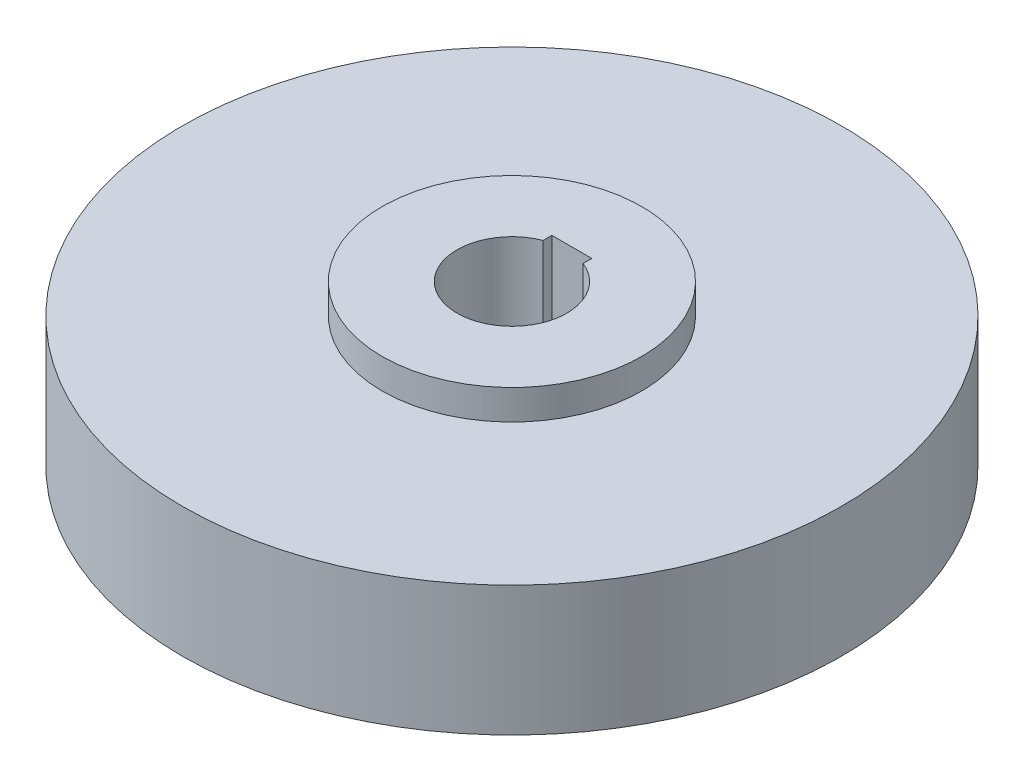
ISO-10303-21;
HEADER;
FILE_DESCRIPTION(('STEP AP214'),'2;1');
FILE_NAME('part.step','',(''),(''),'','','');
FILE_SCHEMA(('AUTOMOTIVE_DESIGN { 1 0 10303 214 1 1 1 1 }'));
ENDSEC;
DATA;
#1=APPLICATION_CONTEXT('core data for automotive mechanical design processes');
#2=APPLICATION_PROTOCOL_DEFINITION('international standard','automotive_design',2000,#1);
#3=PRODUCT_CONTEXT('',#1,'mechanical');
#4=PRODUCT('Part','Part','',(#3));
#5=PRODUCT_RELATED_PRODUCT_CATEGORY('part','',(#4));
#6=PRODUCT_DEFINITION_FORMATION('','',#4);
#7=PRODUCT_DEFINITION_CONTEXT('part definition',#1,'design');
#8=PRODUCT_DEFINITION('design','',#6,#7);
#9=PRODUCT_DEFINITION_SHAPE('','',#8);
#10=(LENGTH_UNIT() NAMED_UNIT(*) SI_UNIT(.MILLI.,.METRE.));
#11=(NAMED_UNIT(*) PLANE_ANGLE_UNIT() SI_UNIT($,.RADIAN.));
#12=(NAMED_UNIT(*) SI_UNIT($,.STERADIAN.) SOLID_ANGLE_UNIT());
#13=UNCERTAINTY_MEASURE_WITH_UNIT(LENGTH_MEASURE(1.E-05),#10,'distance_accuracy_value','');
#14=(GEOMETRIC_REPRESENTATION_CONTEXT(3) GLOBAL_UNCERTAINTY_ASSIGNED_CONTEXT((#13)) GLOBAL_UNIT_ASSIGNED_CONTEXT((#10,
#11,#12)) REPRESENTATION_CONTEXT('',''));
#15=CARTESIAN_POINT('',(0.,0.,0.));
#16=DIRECTION('',(0.,0.,1.));
#17=DIRECTION('',(1.,0.,0.));
#18=AXIS2_PLACEMENT_3D('',#15,#16,#17);
#19=CARTESIAN_POINT('',(0.,13.,0.));
#20=DIRECTION('',(0.,-1.,0.));
#21=DIRECTION('',(0.,0.,-1.));
#22=AXIS2_PLACEMENT_3D('',#19,#20,#21);
#23=CYLINDRICAL_SURFACE('',#22,33.);
#24=CARTESIAN_POINT('',(0.,13.,0.));
#25=DIRECTION('',(0.,1.,0.));
#26=DIRECTION('',(0.,0.,1.));
#27=AXIS2_PLACEMENT_3D('',#24,#25,#26);
#28=CIRCLE('',#27,33.);
#29=CARTESIAN_POINT('',(0.,13.,33.));
#30=VERTEX_POINT('',#29);
#31=EDGE_CURVE('E98',#30,#30,#28,.T.);
#32=ORIENTED_EDGE('',*,*,#31,.F.);
#33=EDGE_LOOP('',(#32));
#34=FACE_BOUND('',#33,.T.);
#35=CARTESIAN_POINT('',(0.,0.,0.));
#36=DIRECTION('',(0.,1.,0.));
#37=DIRECTION('',(0.,0.,1.));
#38=AXIS2_PLACEMENT_3D('',#35,#36,#37);
#39=CIRCLE('',#38,33.);
#40=CARTESIAN_POINT('',(0.,0.,33.));
#41=VERTEX_POINT('',#40);
#42=EDGE_CURVE('E95',#41,#41,#39,.T.);
#43=ORIENTED_EDGE('',*,*,#42,.T.);
#44=EDGE_LOOP('',(#43));
#45=FACE_BOUND('',#44,.T.);
#46=ADVANCED_FACE('F33',(#34,#45),#23,.T.);
#47=CARTESIAN_POINT('',(0.,13.,0.));
#48=DIRECTION('',(0.,1.,0.));
#49=DIRECTION('',(0.,0.,1.));
#50=AXIS2_PLACEMENT_3D('',#47,#48,#49);
#51=PLANE('',#50);
#52=CARTESIAN_POINT('',(0.,13.,0.));
#53=DIRECTION('',(0.,1.,0.));
#54=DIRECTION('',(0.,0.,1.));
#55=AXIS2_PLACEMENT_3D('',#52,#53,#54);
#56=CIRCLE('',#55,13.);
#57=CARTESIAN_POINT('',(0.,13.,13.));
#58=VERTEX_POINT('',#57);
#59=EDGE_CURVE('E94',#58,#58,#56,.T.);
#60=ORIENTED_EDGE('',*,*,#59,.F.);
#61=EDGE_LOOP('',(#60));
#62=FACE_BOUND('',#61,.T.);
#63=ORIENTED_EDGE('',*,*,#31,.T.);
#64=EDGE_LOOP('',(#63));
#65=FACE_BOUND('',#64,.T.);
#66=ADVANCED_FACE('F131',(#62,#65),#51,.T.);
#67=CARTESIAN_POINT('',(0.,0.,0.));
#68=DIRECTION('',(0.,1.,0.));
#69=DIRECTION('',(0.,0.,1.));
#70=AXIS2_PLACEMENT_3D('',#67,#68,#69);
#71=PLANE('',#70);
#72=DIRECTION('',(0.,0.,1.));
#73=VECTOR('',#72,1.);
#74=CARTESIAN_POINT('',(-2.,0.,0.));
#75=LINE('',#74,#73);
#76=CARTESIAN_POINT('',(-2.,0.,-6.));
#77=VERTEX_POINT('',#76);
#78=CARTESIAN_POINT('',(-2.,0.,-5.1234753829798));
#79=VERTEX_POINT('',#78);
#80=EDGE_CURVE('E85',#77,#79,#75,.T.);
#81=ORIENTED_EDGE('',*,*,#80,.T.);
#82=CARTESIAN_POINT('',(0.,0.,0.));
#83=DIRECTION('',(0.,1.,0.));
#84=DIRECTION('',(0.,0.,1.));
#85=AXIS2_PLACEMENT_3D('',#82,#83,#84);
#86=CIRCLE('',#85,5.5);
#87=CARTESIAN_POINT('',(2.,0.,-5.1234753829798));
#88=VERTEX_POINT('',#87);
#89=EDGE_CURVE('E114',#79,#88,#86,.T.);
#90=ORIENTED_EDGE('',*,*,#89,.T.);
#91=DIRECTION('',(0.,0.,1.));
#92=VECTOR('',#91,1.);
#93=CARTESIAN_POINT('',(2.,0.,0.));
#94=LINE('',#93,#92);
#95=CARTESIAN_POINT('',(2.,0.,-6.));
#96=VERTEX_POINT('',#95);
#97=EDGE_CURVE('E65',#96,#88,#94,.T.);
#98=ORIENTED_EDGE('',*,*,#97,.F.);
#99=DIRECTION('',(1.,0.,0.));
#100=VECTOR('',#99,1.);
#101=CARTESIAN_POINT('',(0.,0.,-6.));
#102=LINE('',#101,#100);
#103=EDGE_CURVE('E111',#77,#96,#102,.T.);
#104=ORIENTED_EDGE('',*,*,#103,.F.);
#105=EDGE_LOOP('',(#81,#90,#98,#104));
#106=FACE_BOUND('',#105,.T.);
#107=ORIENTED_EDGE('',*,*,#42,.F.);
#108=EDGE_LOOP('',(#107));
#109=FACE_BOUND('',#108,.T.);
#110=ADVANCED_FACE('F118',(#106,#109),#71,.F.);
#111=CARTESIAN_POINT('',(0.,16.,0.));
#112=DIRECTION('',(0.,-1.,0.));
#113=DIRECTION('',(0.,0.,-1.));
#114=AXIS2_PLACEMENT_3D('',#111,#112,#113);
#115=CYLINDRICAL_SURFACE('',#114,13.);
#116=CARTESIAN_POINT('',(0.,16.,0.));
#117=DIRECTION('',(0.,1.,0.));
#118=DIRECTION('',(0.,0.,1.));
#119=AXIS2_PLACEMENT_3D('',#116,#117,#118);
#120=CIRCLE('',#119,13.);
#121=CARTESIAN_POINT('',(0.,16.,13.));
#122=VERTEX_POINT('',#121);
#123=EDGE_CURVE('E99',#122,#122,#120,.T.);
#124=ORIENTED_EDGE('',*,*,#123,.F.);
#125=EDGE_LOOP('',(#124));
#126=FACE_BOUND('',#125,.T.);
#127=ORIENTED_EDGE('',*,*,#59,.T.);
#128=EDGE_LOOP('',(#127));
#129=FACE_BOUND('',#128,.T.);
#130=ADVANCED_FACE('F142',(#126,#129),#115,.T.);
#131=CARTESIAN_POINT('',(0.,16.,0.));
#132=DIRECTION('',(0.,1.,0.));
#133=DIRECTION('',(0.,0.,1.));
#134=AXIS2_PLACEMENT_3D('',#131,#132,#133);
#135=PLANE('',#134);
#136=CARTESIAN_POINT('',(0.,16.,0.));
#137=DIRECTION('',(0.,1.,0.));
#138=DIRECTION('',(0.,0.,1.));
#139=AXIS2_PLACEMENT_3D('',#136,#137,#138);
#140=CIRCLE('',#139,5.5);
#141=CARTESIAN_POINT('',(-2.,16.,-5.1234753829798));
#142=VERTEX_POINT('',#141);
#143=CARTESIAN_POINT('',(2.,16.,-5.1234753829798));
#144=VERTEX_POINT('',#143);
#145=EDGE_CURVE('E11',#142,#144,#140,.T.);
#146=ORIENTED_EDGE('',*,*,#145,.F.);
#147=DIRECTION('',(0.,0.,1.));
#148=VECTOR('',#147,1.);
#149=CARTESIAN_POINT('',(-2.,16.,0.));
#150=LINE('',#149,#148);
#151=CARTESIAN_POINT('',(-2.,16.,-6.));
#152=VERTEX_POINT('',#151);
#153=EDGE_CURVE('E41',#152,#142,#150,.T.);
#154=ORIENTED_EDGE('',*,*,#153,.F.);
#155=DIRECTION('',(1.,0.,0.));
#156=VECTOR('',#155,1.);
#157=CARTESIAN_POINT('',(0.,16.,-6.));
#158=LINE('',#157,#156);
#159=CARTESIAN_POINT('',(2.,16.,-6.));
#160=VERTEX_POINT('',#159);
#161=EDGE_CURVE('E77',#152,#160,#158,.T.);
#162=ORIENTED_EDGE('',*,*,#161,.T.);
#163=DIRECTION('',(0.,0.,1.));
#164=VECTOR('',#163,1.);
#165=CARTESIAN_POINT('',(2.,16.,0.));
#166=LINE('',#165,#164);
#167=EDGE_CURVE('E73',#160,#144,#166,.T.);
#168=ORIENTED_EDGE('',*,*,#167,.T.);
#169=EDGE_LOOP('',(#146,#154,#162,#168));
#170=FACE_BOUND('',#169,.T.);
#171=ORIENTED_EDGE('',*,*,#123,.T.);
#172=EDGE_LOOP('',(#171));
#173=FACE_BOUND('',#172,.T.);
#174=ADVANCED_FACE('F90',(#170,#173),#135,.T.);
#175=CARTESIAN_POINT('',(0.,0.,0.));
#176=DIRECTION('',(0.,1.,0.));
#177=DIRECTION('',(0.,0.,1.));
#178=AXIS2_PLACEMENT_3D('',#175,#176,#177);
#179=CYLINDRICAL_SURFACE('',#178,5.5);
#180=ORIENTED_EDGE('',*,*,#145,.T.);
#181=DIRECTION('',(0.,1.,0.));
#182=VECTOR('',#181,1.);
#183=CARTESIAN_POINT('',(2.,0.,-5.1234753829798));
#184=LINE('',#183,#182);
#185=EDGE_CURVE('E106',#88,#144,#184,.T.);
#186=ORIENTED_EDGE('',*,*,#185,.F.);
#187=ORIENTED_EDGE('',*,*,#89,.F.);
#188=DIRECTION('',(0.,1.,0.));
#189=VECTOR('',#188,1.);
#190=CARTESIAN_POINT('',(-2.,0.,-5.1234753829798));
#191=LINE('',#190,#189);
#192=EDGE_CURVE('E87',#79,#142,#191,.T.);
#193=ORIENTED_EDGE('',*,*,#192,.T.);
#194=EDGE_LOOP('',(#180,#186,#187,#193));
#195=FACE_BOUND('',#194,.T.);
#196=ADVANCED_FACE('F121',(#195),#179,.F.);
#197=CARTESIAN_POINT('',(-2.,0.,0.));
#198=DIRECTION('',(-1.,0.,0.));
#199=DIRECTION('',(0.,0.,1.));
#200=AXIS2_PLACEMENT_3D('',#197,#198,#199);
#201=PLANE('',#200);
#202=ORIENTED_EDGE('',*,*,#153,.T.);
#203=ORIENTED_EDGE('',*,*,#192,.F.);
#204=ORIENTED_EDGE('',*,*,#80,.F.);
#205=DIRECTION('',(0.,1.,0.));
#206=VECTOR('',#205,1.);
#207=CARTESIAN_POINT('',(-2.,0.,-6.));
#208=LINE('',#207,#206);
#209=EDGE_CURVE('E79',#77,#152,#208,.T.);
#210=ORIENTED_EDGE('',*,*,#209,.T.);
#211=EDGE_LOOP('',(#202,#203,#204,#210));
#212=FACE_BOUND('',#211,.T.);
#213=ADVANCED_FACE('F83',(#212),#201,.F.);
#214=CARTESIAN_POINT('',(0.,0.,-6.));
#215=DIRECTION('',(0.,0.,1.));
#216=DIRECTION('',(1.,0.,0.));
#217=AXIS2_PLACEMENT_3D('',#214,#215,#216);
#218=PLANE('',#217);
#219=ORIENTED_EDGE('',*,*,#209,.F.);
#220=ORIENTED_EDGE('',*,*,#103,.T.);
#221=DIRECTION('',(0.,1.,0.));
#222=VECTOR('',#221,1.);
#223=CARTESIAN_POINT('',(2.,0.,-6.));
#224=LINE('',#223,#222);
#225=EDGE_CURVE('E48',#96,#160,#224,.T.);
#226=ORIENTED_EDGE('',*,*,#225,.T.);
#227=ORIENTED_EDGE('',*,*,#161,.F.);
#228=EDGE_LOOP('',(#219,#220,#226,#227));
#229=FACE_BOUND('',#228,.T.);
#230=ADVANCED_FACE('F78',(#229),#218,.T.);
#231=CARTESIAN_POINT('',(2.,0.,0.));
#232=DIRECTION('',(-1.,0.,0.));
#233=DIRECTION('',(0.,0.,1.));
#234=AXIS2_PLACEMENT_3D('',#231,#232,#233);
#235=PLANE('',#234);
#236=ORIENTED_EDGE('',*,*,#225,.F.);
#237=ORIENTED_EDGE('',*,*,#97,.T.);
#238=ORIENTED_EDGE('',*,*,#185,.T.);
#239=ORIENTED_EDGE('',*,*,#167,.F.);
#240=EDGE_LOOP('',(#236,#237,#238,#239));
#241=FACE_BOUND('',#240,.T.);
#242=ADVANCED_FACE('F122',(#241),#235,.T.);
#243=CLOSED_SHELL('',(#46,#66,#110,#130,#174,#196,#213,#230,#242));
#244=MANIFOLD_SOLID_BREP('B2',#243);
#245=ADVANCED_BREP_SHAPE_REPRESENTATION('',(#18,#244),#14);
#246=SHAPE_DEFINITION_REPRESENTATION(#9,#245);
ENDSEC;
END-ISO-10303-21;
